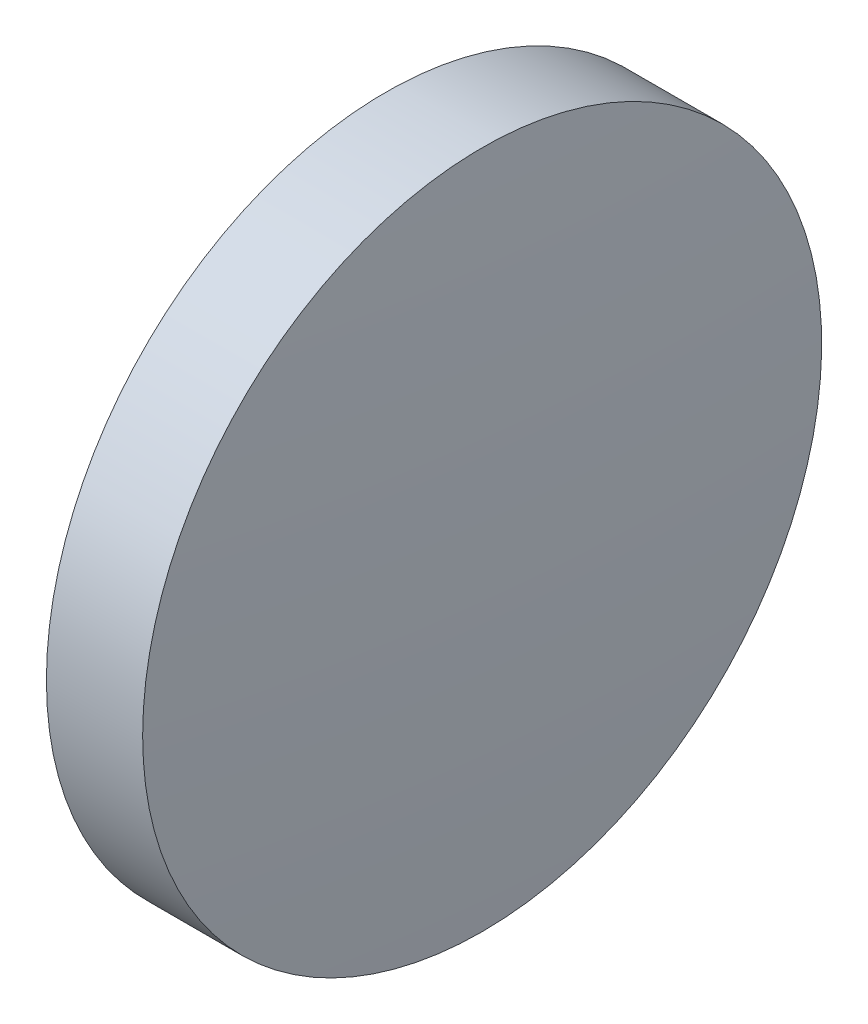
ISO-10303-21;
HEADER;
FILE_DESCRIPTION(('STEP AP214'),'2;1');
FILE_NAME('part.step','',(''),(''),'','','');
FILE_SCHEMA(('AUTOMOTIVE_DESIGN { 1 0 10303 214 1 1 1 1 }'));
ENDSEC;
DATA;
#1=APPLICATION_CONTEXT('core data for automotive mechanical design processes');
#2=APPLICATION_PROTOCOL_DEFINITION('international standard','automotive_design',2000,#1);
#3=PRODUCT_CONTEXT('',#1,'mechanical');
#4=PRODUCT('Part','Part','',(#3));
#5=PRODUCT_RELATED_PRODUCT_CATEGORY('part','',(#4));
#6=PRODUCT_DEFINITION_FORMATION('','',#4);
#7=PRODUCT_DEFINITION_CONTEXT('part definition',#1,'design');
#8=PRODUCT_DEFINITION('design','',#6,#7);
#9=PRODUCT_DEFINITION_SHAPE('','',#8);
#10=(LENGTH_UNIT() NAMED_UNIT(*) SI_UNIT(.MILLI.,.METRE.));
#11=(NAMED_UNIT(*) PLANE_ANGLE_UNIT() SI_UNIT($,.RADIAN.));
#12=(NAMED_UNIT(*) SI_UNIT($,.STERADIAN.) SOLID_ANGLE_UNIT());
#13=UNCERTAINTY_MEASURE_WITH_UNIT(LENGTH_MEASURE(1.E-05),#10,'distance_accuracy_value','');
#14=(GEOMETRIC_REPRESENTATION_CONTEXT(3) GLOBAL_UNCERTAINTY_ASSIGNED_CONTEXT((#13)) GLOBAL_UNIT_ASSIGNED_CONTEXT((#10,
#11,#12)) REPRESENTATION_CONTEXT('',''));
#15=CARTESIAN_POINT('',(0.,0.,0.));
#16=DIRECTION('',(0.,0.,1.));
#17=DIRECTION('',(1.,0.,0.));
#18=AXIS2_PLACEMENT_3D('',#15,#16,#17);
#19=CARTESIAN_POINT('',(232.285022609178,147.019019429669,0.));
#20=DIRECTION('',(-1.,0.,0.));
#21=DIRECTION('',(0.,-1.,0.));
#22=AXIS2_PLACEMENT_3D('',#19,#20,#21);
#23=SPHERICAL_SURFACE('',#22,201.812499999997);
#24=CARTESIAN_POINT('',(433.697522609176,147.019019429669,0.));
#25=DIRECTION('',(-1.,0.,0.));
#26=DIRECTION('',(0.,0.,1.));
#27=AXIS2_PLACEMENT_3D('',#24,#25,#26);
#28=CIRCLE('',#27,12.7);
#29=CARTESIAN_POINT('',(433.697522609176,147.019019429669,12.7));
#30=VERTEX_POINT('',#29);
#31=EDGE_CURVE('E10',#30,#30,#28,.T.);
#32=ORIENTED_EDGE('',*,*,#31,.F.);
#33=EDGE_LOOP('',(#32));
#34=FACE_BOUND('',#33,.T.);
#35=ADVANCED_FACE('F35',(#34),#23,.T.);
#36=CARTESIAN_POINT('',(424.467626558018,147.019019429669,0.));
#37=DIRECTION('',(-1.,0.,0.));
#38=DIRECTION('',(0.,0.,1.));
#39=AXIS2_PLACEMENT_3D('',#36,#37,#38);
#40=CYLINDRICAL_SURFACE('',#39,12.7);
#41=CARTESIAN_POINT('',(430.097522609176,147.019019429669,0.));
#42=DIRECTION('',(-1.,0.,0.));
#43=DIRECTION('',(0.,0.,1.));
#44=AXIS2_PLACEMENT_3D('',#41,#42,#43);
#45=CIRCLE('',#44,12.7);
#46=CARTESIAN_POINT('',(430.097522609176,147.019019429669,12.7));
#47=VERTEX_POINT('',#46);
#48=EDGE_CURVE('E41',#47,#47,#45,.T.);
#49=ORIENTED_EDGE('',*,*,#48,.F.);
#50=EDGE_LOOP('',(#49));
#51=FACE_BOUND('',#50,.T.);
#52=ORIENTED_EDGE('',*,*,#31,.T.);
#53=EDGE_LOOP('',(#52));
#54=FACE_BOUND('',#53,.T.);
#55=ADVANCED_FACE('F49',(#51,#54),#40,.T.);
#56=CARTESIAN_POINT('',(430.097522609176,147.019019429669,0.));
#57=DIRECTION('',(1.,0.,0.));
#58=DIRECTION('',(0.,0.,-1.));
#59=AXIS2_PLACEMENT_3D('',#56,#57,#58);
#60=PLANE('',#59);
#61=ORIENTED_EDGE('',*,*,#48,.T.);
#62=EDGE_LOOP('',(#61));
#63=FACE_BOUND('',#62,.T.);
#64=ADVANCED_FACE('F47',(#63),#60,.F.);
#65=CLOSED_SHELL('',(#35,#55,#64));
#66=MANIFOLD_SOLID_BREP('B2',#65);
#67=ADVANCED_BREP_SHAPE_REPRESENTATION('',(#18,#66),#14);
#68=SHAPE_DEFINITION_REPRESENTATION(#9,#67);
ENDSEC;
END-ISO-10303-21;
